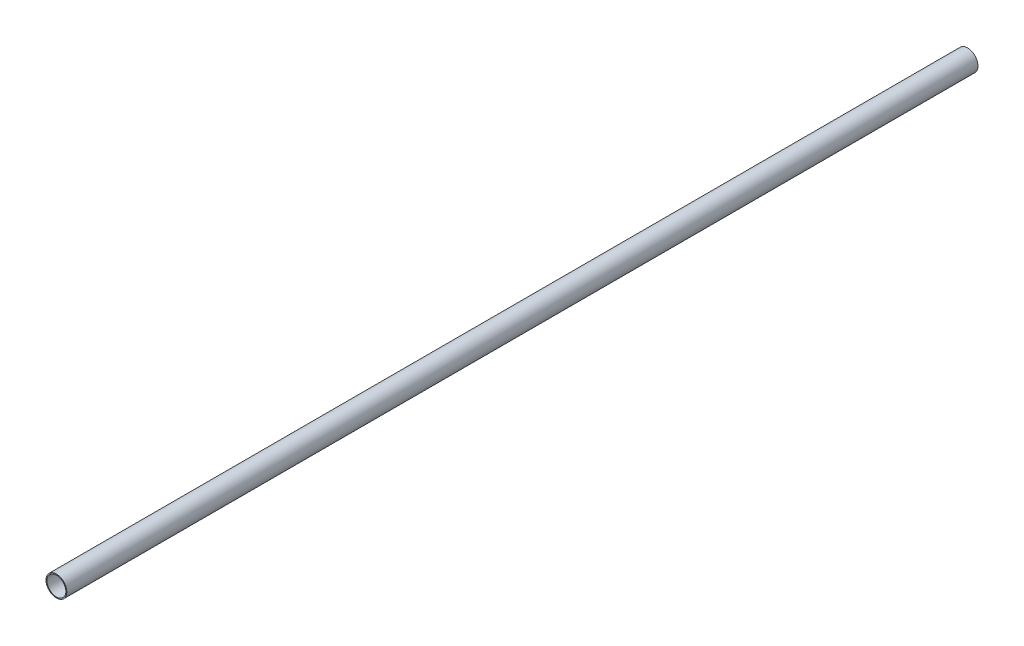
ISO-10303-21;
HEADER;
FILE_DESCRIPTION(('STEP AP214'),'2;1');
FILE_NAME('part.step','',(''),(''),'','','');
FILE_SCHEMA(('AUTOMOTIVE_DESIGN { 1 0 10303 214 1 1 1 1 }'));
ENDSEC;
DATA;
#1=APPLICATION_CONTEXT('core data for automotive mechanical design processes');
#2=APPLICATION_PROTOCOL_DEFINITION('international standard','automotive_design',2000,#1);
#3=PRODUCT_CONTEXT('',#1,'mechanical');
#4=PRODUCT('Part','Part','',(#3));
#5=PRODUCT_RELATED_PRODUCT_CATEGORY('part','',(#4));
#6=PRODUCT_DEFINITION_FORMATION('','',#4);
#7=PRODUCT_DEFINITION_CONTEXT('part definition',#1,'design');
#8=PRODUCT_DEFINITION('design','',#6,#7);
#9=PRODUCT_DEFINITION_SHAPE('','',#8);
#10=(LENGTH_UNIT() NAMED_UNIT(*) SI_UNIT(.MILLI.,.METRE.));
#11=(NAMED_UNIT(*) PLANE_ANGLE_UNIT() SI_UNIT($,.RADIAN.));
#12=(NAMED_UNIT(*) SI_UNIT($,.STERADIAN.) SOLID_ANGLE_UNIT());
#13=UNCERTAINTY_MEASURE_WITH_UNIT(LENGTH_MEASURE(1.E-05),#10,'distance_accuracy_value','');
#14=(GEOMETRIC_REPRESENTATION_CONTEXT(3) GLOBAL_UNCERTAINTY_ASSIGNED_CONTEXT((#13)) GLOBAL_UNIT_ASSIGNED_CONTEXT((#10,
#11,#12)) REPRESENTATION_CONTEXT('',''));
#15=CARTESIAN_POINT('',(0.,0.,0.));
#16=DIRECTION('',(0.,0.,1.));
#17=DIRECTION('',(1.,0.,0.));
#18=AXIS2_PLACEMENT_3D('',#15,#16,#17);
#19=CARTESIAN_POINT('',(0.,0.,1400.));
#20=DIRECTION('',(0.,0.,1.));
#21=DIRECTION('',(1.,0.,0.));
#22=AXIS2_PLACEMENT_3D('',#19,#20,#21);
#23=PLANE('',#22);
#24=CARTESIAN_POINT('',(0.,0.,1400.));
#25=DIRECTION('',(0.,0.,1.));
#26=DIRECTION('',(1.,0.,0.));
#27=AXIS2_PLACEMENT_3D('',#24,#25,#26);
#28=CIRCLE('',#27,16.);
#29=CARTESIAN_POINT('',(16.,0.,1400.));
#30=VERTEX_POINT('',#29);
#31=EDGE_CURVE('E10',#30,#30,#28,.T.);
#32=ORIENTED_EDGE('',*,*,#31,.T.);
#33=EDGE_LOOP('',(#32));
#34=FACE_BOUND('',#33,.T.);
#35=CARTESIAN_POINT('',(0.,0.,1400.));
#36=DIRECTION('',(0.,0.,1.));
#37=DIRECTION('',(1.,0.,0.));
#38=AXIS2_PLACEMENT_3D('',#35,#36,#37);
#39=CIRCLE('',#38,14.5);
#40=CARTESIAN_POINT('',(14.5,0.,1400.));
#41=VERTEX_POINT('',#40);
#42=EDGE_CURVE('E46',#41,#41,#39,.T.);
#43=ORIENTED_EDGE('',*,*,#42,.F.);
#44=EDGE_LOOP('',(#43));
#45=FACE_BOUND('',#44,.T.);
#46=ADVANCED_FACE('F35',(#34,#45),#23,.T.);
#47=CARTESIAN_POINT('',(0.,0.,0.));
#48=DIRECTION('',(0.,0.,1.));
#49=DIRECTION('',(1.,0.,0.));
#50=AXIS2_PLACEMENT_3D('',#47,#48,#49);
#51=PLANE('',#50);
#52=CARTESIAN_POINT('',(0.,0.,0.));
#53=DIRECTION('',(0.,0.,1.));
#54=DIRECTION('',(1.,0.,0.));
#55=AXIS2_PLACEMENT_3D('',#52,#53,#54);
#56=CIRCLE('',#55,16.);
#57=CARTESIAN_POINT('',(16.,0.,0.));
#58=VERTEX_POINT('',#57);
#59=EDGE_CURVE('E39',#58,#58,#56,.T.);
#60=ORIENTED_EDGE('',*,*,#59,.F.);
#61=EDGE_LOOP('',(#60));
#62=FACE_BOUND('',#61,.T.);
#63=CARTESIAN_POINT('',(0.,0.,0.));
#64=DIRECTION('',(0.,0.,1.));
#65=DIRECTION('',(1.,0.,0.));
#66=AXIS2_PLACEMENT_3D('',#63,#64,#65);
#67=CIRCLE('',#66,14.5);
#68=CARTESIAN_POINT('',(14.5,0.,0.));
#69=VERTEX_POINT('',#68);
#70=EDGE_CURVE('E48',#69,#69,#67,.T.);
#71=ORIENTED_EDGE('',*,*,#70,.T.);
#72=EDGE_LOOP('',(#71));
#73=FACE_BOUND('',#72,.T.);
#74=ADVANCED_FACE('F58',(#62,#73),#51,.F.);
#75=CARTESIAN_POINT('',(0.,0.,1400.));
#76=DIRECTION('',(0.,0.,-1.));
#77=DIRECTION('',(-1.,0.,0.));
#78=AXIS2_PLACEMENT_3D('',#75,#76,#77);
#79=CYLINDRICAL_SURFACE('',#78,16.);
#80=ORIENTED_EDGE('',*,*,#31,.F.);
#81=EDGE_LOOP('',(#80));
#82=FACE_BOUND('',#81,.T.);
#83=ORIENTED_EDGE('',*,*,#59,.T.);
#84=EDGE_LOOP('',(#83));
#85=FACE_BOUND('',#84,.T.);
#86=ADVANCED_FACE('F37',(#82,#85),#79,.T.);
#87=CARTESIAN_POINT('',(0.,0.,1400.));
#88=DIRECTION('',(0.,0.,-1.));
#89=DIRECTION('',(-1.,0.,0.));
#90=AXIS2_PLACEMENT_3D('',#87,#88,#89);
#91=CYLINDRICAL_SURFACE('',#90,14.5);
#92=ORIENTED_EDGE('',*,*,#42,.T.);
#93=EDGE_LOOP('',(#92));
#94=FACE_BOUND('',#93,.T.);
#95=ORIENTED_EDGE('',*,*,#70,.F.);
#96=EDGE_LOOP('',(#95));
#97=FACE_BOUND('',#96,.T.);
#98=ADVANCED_FACE('F54',(#94,#97),#91,.F.);
#99=CLOSED_SHELL('',(#46,#74,#86,#98));
#100=MANIFOLD_SOLID_BREP('B2',#99);
#101=ADVANCED_BREP_SHAPE_REPRESENTATION('',(#18,#100),#14);
#102=SHAPE_DEFINITION_REPRESENTATION(#9,#101);
ENDSEC;
END-ISO-10303-21;
